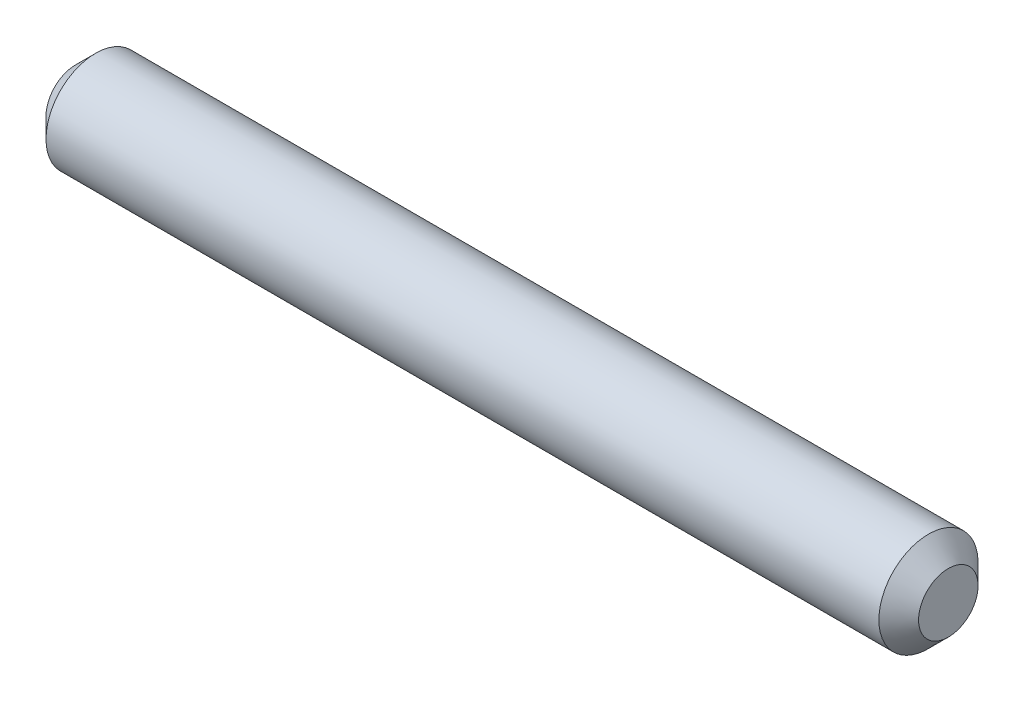
ISO-10303-21;
HEADER;
FILE_DESCRIPTION(('STEP AP214'),'2;1');
FILE_NAME('part.step','',(''),(''),'','','');
FILE_SCHEMA(('AUTOMOTIVE_DESIGN { 1 0 10303 214 1 1 1 1 }'));
ENDSEC;
DATA;
#1=APPLICATION_CONTEXT('core data for automotive mechanical design processes');
#2=APPLICATION_PROTOCOL_DEFINITION('international standard','automotive_design',2000,#1);
#3=PRODUCT_CONTEXT('',#1,'mechanical');
#4=PRODUCT('Part','Part','',(#3));
#5=PRODUCT_RELATED_PRODUCT_CATEGORY('part','',(#4));
#6=PRODUCT_DEFINITION_FORMATION('','',#4);
#7=PRODUCT_DEFINITION_CONTEXT('part definition',#1,'design');
#8=PRODUCT_DEFINITION('design','',#6,#7);
#9=PRODUCT_DEFINITION_SHAPE('','',#8);
#10=(LENGTH_UNIT() NAMED_UNIT(*) SI_UNIT(.MILLI.,.METRE.));
#11=(NAMED_UNIT(*) PLANE_ANGLE_UNIT() SI_UNIT($,.RADIAN.));
#12=(NAMED_UNIT(*) SI_UNIT($,.STERADIAN.) SOLID_ANGLE_UNIT());
#13=UNCERTAINTY_MEASURE_WITH_UNIT(LENGTH_MEASURE(1.E-05),#10,'distance_accuracy_value','');
#14=(GEOMETRIC_REPRESENTATION_CONTEXT(3) GLOBAL_UNCERTAINTY_ASSIGNED_CONTEXT((#13)) GLOBAL_UNIT_ASSIGNED_CONTEXT((#10,
#11,#12)) REPRESENTATION_CONTEXT('',''));
#15=CARTESIAN_POINT('',(0.,0.,0.));
#16=DIRECTION('',(0.,0.,1.));
#17=DIRECTION('',(1.,0.,0.));
#18=AXIS2_PLACEMENT_3D('',#15,#16,#17);
#19=CARTESIAN_POINT('',(0.,0.,0.));
#20=DIRECTION('',(1.,0.,0.));
#21=DIRECTION('',(0.,0.,-1.));
#22=AXIS2_PLACEMENT_3D('',#19,#20,#21);
#23=PLANE('',#22);
#24=CARTESIAN_POINT('',(0.,0.,0.));
#25=DIRECTION('',(-1.,0.,0.));
#26=DIRECTION('',(0.,0.,1.));
#27=AXIS2_PLACEMENT_3D('',#24,#25,#26);
#28=CIRCLE('',#27,1.5);
#29=CARTESIAN_POINT('',(0.,0.,1.5));
#30=VERTEX_POINT('',#29);
#31=EDGE_CURVE('E10',#30,#30,#28,.T.);
#32=ORIENTED_EDGE('',*,*,#31,.T.);
#33=EDGE_LOOP('',(#32));
#34=FACE_BOUND('',#33,.T.);
#35=ADVANCED_FACE('F37',(#34),#23,.F.);
#36=CARTESIAN_POINT('',(1.,0.,0.));
#37=DIRECTION('',(1.,0.,0.));
#38=DIRECTION('',(0.,0.,-1.));
#39=AXIS2_PLACEMENT_3D('',#36,#37,#38);
#40=CONICAL_SURFACE('',#39,2.5,0.785398163397448);
#41=ORIENTED_EDGE('',*,*,#31,.F.);
#42=EDGE_LOOP('',(#41));
#43=FACE_BOUND('',#42,.T.);
#44=CARTESIAN_POINT('',(1.,0.,0.));
#45=DIRECTION('',(-1.,0.,0.));
#46=DIRECTION('',(0.,0.,1.));
#47=AXIS2_PLACEMENT_3D('',#44,#45,#46);
#48=CIRCLE('',#47,2.5);
#49=CARTESIAN_POINT('',(1.,0.,2.5));
#50=VERTEX_POINT('',#49);
#51=EDGE_CURVE('E44',#50,#50,#48,.T.);
#52=ORIENTED_EDGE('',*,*,#51,.T.);
#53=EDGE_LOOP('',(#52));
#54=FACE_BOUND('',#53,.T.);
#55=ADVANCED_FACE('F73',(#43,#54),#40,.T.);
#56=CARTESIAN_POINT('',(0.,0.,0.));
#57=DIRECTION('',(-1.,0.,0.));
#58=DIRECTION('',(0.,0.,1.));
#59=AXIS2_PLACEMENT_3D('',#56,#57,#58);
#60=CYLINDRICAL_SURFACE('',#59,2.5);
#61=ORIENTED_EDGE('',*,*,#51,.F.);
#62=EDGE_LOOP('',(#61));
#63=FACE_BOUND('',#62,.T.);
#64=CARTESIAN_POINT('',(43.,0.,0.));
#65=DIRECTION('',(-1.,0.,0.));
#66=DIRECTION('',(0.,0.,1.));
#67=AXIS2_PLACEMENT_3D('',#64,#65,#66);
#68=CIRCLE('',#67,2.5);
#69=CARTESIAN_POINT('',(43.,0.,2.5));
#70=VERTEX_POINT('',#69);
#71=EDGE_CURVE('E49',#70,#70,#68,.T.);
#72=ORIENTED_EDGE('',*,*,#71,.T.);
#73=EDGE_LOOP('',(#72));
#74=FACE_BOUND('',#73,.T.);
#75=ADVANCED_FACE('F69',(#63,#74),#60,.T.);
#76=CARTESIAN_POINT('',(44.,0.,0.));
#77=DIRECTION('',(-1.,0.,0.));
#78=DIRECTION('',(0.,0.,1.));
#79=AXIS2_PLACEMENT_3D('',#76,#77,#78);
#80=CONICAL_SURFACE('',#79,1.5,0.785398163397448);
#81=ORIENTED_EDGE('',*,*,#71,.F.);
#82=EDGE_LOOP('',(#81));
#83=FACE_BOUND('',#82,.T.);
#84=CARTESIAN_POINT('',(44.,0.,0.));
#85=DIRECTION('',(-1.,0.,0.));
#86=DIRECTION('',(0.,0.,1.));
#87=AXIS2_PLACEMENT_3D('',#84,#85,#86);
#88=CIRCLE('',#87,1.5);
#89=CARTESIAN_POINT('',(44.,0.,1.5));
#90=VERTEX_POINT('',#89);
#91=EDGE_CURVE('E54',#90,#90,#88,.T.);
#92=ORIENTED_EDGE('',*,*,#91,.T.);
#93=EDGE_LOOP('',(#92));
#94=FACE_BOUND('',#93,.T.);
#95=ADVANCED_FACE('F61',(#83,#94),#80,.T.);
#96=CARTESIAN_POINT('',(44.,0.,0.));
#97=DIRECTION('',(-1.,0.,0.));
#98=DIRECTION('',(0.,0.,1.));
#99=AXIS2_PLACEMENT_3D('',#96,#97,#98);
#100=PLANE('',#99);
#101=ORIENTED_EDGE('',*,*,#91,.F.);
#102=EDGE_LOOP('',(#101));
#103=FACE_BOUND('',#102,.T.);
#104=ADVANCED_FACE('F63',(#103),#100,.F.);
#105=CLOSED_SHELL('',(#35,#55,#75,#95,#104));
#106=MANIFOLD_SOLID_BREP('B2',#105);
#107=ADVANCED_BREP_SHAPE_REPRESENTATION('',(#18,#106),#14);
#108=SHAPE_DEFINITION_REPRESENTATION(#9,#107);
ENDSEC;
END-ISO-10303-21;
